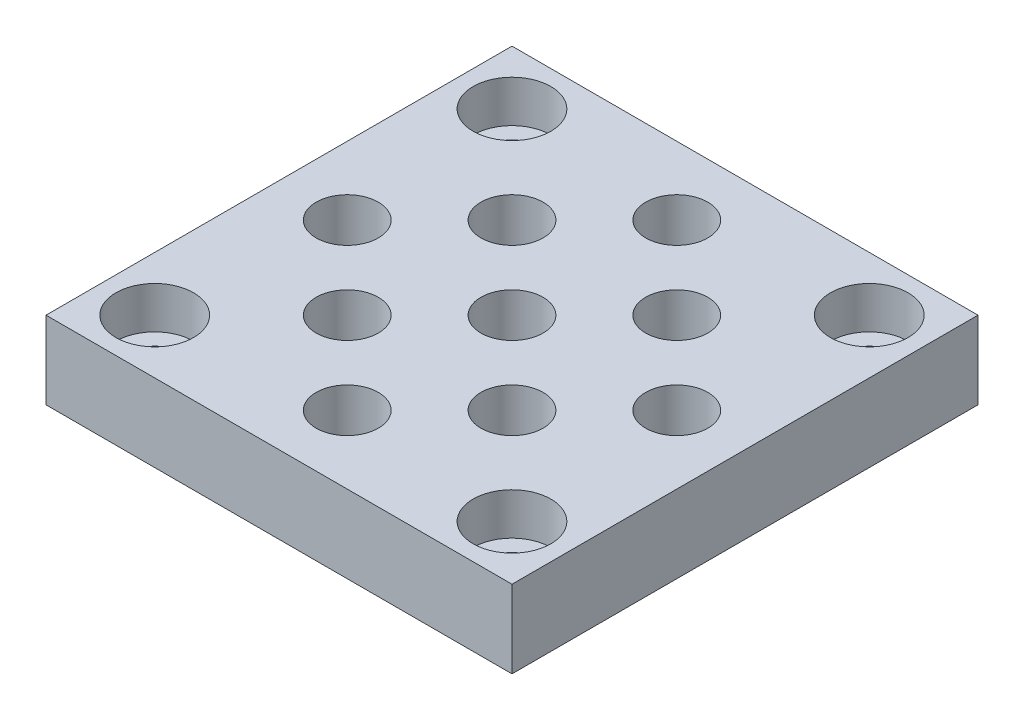
ISO-10303-21;
HEADER;
FILE_DESCRIPTION(('STEP AP214'),'2;1');
FILE_NAME('part.step','',(''),(''),'','','');
FILE_SCHEMA(('AUTOMOTIVE_DESIGN { 1 0 10303 214 1 1 1 1 }'));
ENDSEC;
DATA;
#1=APPLICATION_CONTEXT('core data for automotive mechanical design processes');
#2=APPLICATION_PROTOCOL_DEFINITION('international standard','automotive_design',2000,#1);
#3=PRODUCT_CONTEXT('',#1,'mechanical');
#4=PRODUCT('Part','Part','',(#3));
#5=PRODUCT_RELATED_PRODUCT_CATEGORY('part','',(#4));
#6=PRODUCT_DEFINITION_FORMATION('','',#4);
#7=PRODUCT_DEFINITION_CONTEXT('part definition',#1,'design');
#8=PRODUCT_DEFINITION('design','',#6,#7);
#9=PRODUCT_DEFINITION_SHAPE('','',#8);
#10=(LENGTH_UNIT() NAMED_UNIT(*) SI_UNIT(.MILLI.,.METRE.));
#11=(NAMED_UNIT(*) PLANE_ANGLE_UNIT() SI_UNIT($,.RADIAN.));
#12=(NAMED_UNIT(*) SI_UNIT($,.STERADIAN.) SOLID_ANGLE_UNIT());
#13=UNCERTAINTY_MEASURE_WITH_UNIT(LENGTH_MEASURE(1.E-05),#10,'distance_accuracy_value','');
#14=(GEOMETRIC_REPRESENTATION_CONTEXT(3) GLOBAL_UNCERTAINTY_ASSIGNED_CONTEXT((#13)) GLOBAL_UNIT_ASSIGNED_CONTEXT((#10,
#11,#12)) REPRESENTATION_CONTEXT('',''));
#15=CARTESIAN_POINT('',(0.,0.,0.));
#16=DIRECTION('',(0.,0.,1.));
#17=DIRECTION('',(1.,0.,0.));
#18=AXIS2_PLACEMENT_3D('',#15,#16,#17);
#19=CARTESIAN_POINT('',(30.,10.,-30.));
#20=DIRECTION('',(-1.,0.,0.));
#21=DIRECTION('',(0.,0.,1.));
#22=AXIS2_PLACEMENT_3D('',#19,#20,#21);
#23=PLANE('',#22);
#24=DIRECTION('',(0.,0.,-1.));
#25=VECTOR('',#24,1.);
#26=CARTESIAN_POINT('',(30.,0.,-30.));
#27=LINE('',#26,#25);
#28=CARTESIAN_POINT('',(30.,0.,30.));
#29=VERTEX_POINT('',#28);
#30=CARTESIAN_POINT('',(30.,0.,-30.));
#31=VERTEX_POINT('',#30);
#32=EDGE_CURVE('E113',#29,#31,#27,.T.);
#33=ORIENTED_EDGE('',*,*,#32,.T.);
#34=DIRECTION('',(0.,-1.,0.));
#35=VECTOR('',#34,1.);
#36=CARTESIAN_POINT('',(30.,10.,-30.));
#37=LINE('',#36,#35);
#38=CARTESIAN_POINT('',(30.,10.,-30.));
#39=VERTEX_POINT('',#38);
#40=EDGE_CURVE('E104',#39,#31,#37,.T.);
#41=ORIENTED_EDGE('',*,*,#40,.F.);
#42=DIRECTION('',(0.,0.,-1.));
#43=VECTOR('',#42,1.);
#44=CARTESIAN_POINT('',(30.,10.,-30.));
#45=LINE('',#44,#43);
#46=CARTESIAN_POINT('',(30.,10.,30.));
#47=VERTEX_POINT('',#46);
#48=EDGE_CURVE('E98',#47,#39,#45,.T.);
#49=ORIENTED_EDGE('',*,*,#48,.F.);
#50=DIRECTION('',(0.,-1.,0.));
#51=VECTOR('',#50,1.);
#52=CARTESIAN_POINT('',(30.,10.,30.));
#53=LINE('',#52,#51);
#54=EDGE_CURVE('E109',#47,#29,#53,.T.);
#55=ORIENTED_EDGE('',*,*,#54,.T.);
#56=EDGE_LOOP('',(#33,#41,#49,#55));
#57=FACE_BOUND('',#56,.T.);
#58=ADVANCED_FACE('F44',(#57),#23,.F.);
#59=CARTESIAN_POINT('',(-30.,10.,-30.));
#60=DIRECTION('',(0.,0.,1.));
#61=DIRECTION('',(1.,0.,0.));
#62=AXIS2_PLACEMENT_3D('',#59,#60,#61);
#63=PLANE('',#62);
#64=DIRECTION('',(-1.,0.,0.));
#65=VECTOR('',#64,1.);
#66=CARTESIAN_POINT('',(-30.,0.,-30.));
#67=LINE('',#66,#65);
#68=CARTESIAN_POINT('',(-30.,0.,-30.));
#69=VERTEX_POINT('',#68);
#70=EDGE_CURVE('E103',#31,#69,#67,.T.);
#71=ORIENTED_EDGE('',*,*,#70,.T.);
#72=DIRECTION('',(0.,-1.,0.));
#73=VECTOR('',#72,1.);
#74=CARTESIAN_POINT('',(-30.,10.,-30.));
#75=LINE('',#74,#73);
#76=CARTESIAN_POINT('',(-30.,10.,-30.));
#77=VERTEX_POINT('',#76);
#78=EDGE_CURVE('E101',#77,#69,#75,.T.);
#79=ORIENTED_EDGE('',*,*,#78,.F.);
#80=DIRECTION('',(-1.,0.,0.));
#81=VECTOR('',#80,1.);
#82=CARTESIAN_POINT('',(-30.,10.,-30.));
#83=LINE('',#82,#81);
#84=EDGE_CURVE('E92',#39,#77,#83,.T.);
#85=ORIENTED_EDGE('',*,*,#84,.F.);
#86=ORIENTED_EDGE('',*,*,#40,.T.);
#87=EDGE_LOOP('',(#71,#79,#85,#86));
#88=FACE_BOUND('',#87,.T.);
#89=ADVANCED_FACE('F102',(#88),#63,.F.);
#90=CARTESIAN_POINT('',(-30.,10.,-30.));
#91=DIRECTION('',(1.,0.,0.));
#92=DIRECTION('',(0.,0.,-1.));
#93=AXIS2_PLACEMENT_3D('',#90,#91,#92);
#94=PLANE('',#93);
#95=DIRECTION('',(0.,0.,1.));
#96=VECTOR('',#95,1.);
#97=CARTESIAN_POINT('',(-30.,0.,-30.));
#98=LINE('',#97,#96);
#99=CARTESIAN_POINT('',(-30.,0.,30.));
#100=VERTEX_POINT('',#99);
#101=EDGE_CURVE('E78',#69,#100,#98,.T.);
#102=ORIENTED_EDGE('',*,*,#101,.T.);
#103=DIRECTION('',(0.,-1.,0.));
#104=VECTOR('',#103,1.);
#105=CARTESIAN_POINT('',(-30.,10.,30.));
#106=LINE('',#105,#104);
#107=CARTESIAN_POINT('',(-30.,10.,30.));
#108=VERTEX_POINT('',#107);
#109=EDGE_CURVE('E105',#108,#100,#106,.T.);
#110=ORIENTED_EDGE('',*,*,#109,.F.);
#111=DIRECTION('',(0.,0.,1.));
#112=VECTOR('',#111,1.);
#113=CARTESIAN_POINT('',(-30.,10.,-30.));
#114=LINE('',#113,#112);
#115=EDGE_CURVE('E96',#77,#108,#114,.T.);
#116=ORIENTED_EDGE('',*,*,#115,.F.);
#117=ORIENTED_EDGE('',*,*,#78,.T.);
#118=EDGE_LOOP('',(#102,#110,#116,#117));
#119=FACE_BOUND('',#118,.T.);
#120=ADVANCED_FACE('F107',(#119),#94,.F.);
#121=CARTESIAN_POINT('',(-30.,10.,30.));
#122=DIRECTION('',(0.,0.,-1.));
#123=DIRECTION('',(-1.,0.,0.));
#124=AXIS2_PLACEMENT_3D('',#121,#122,#123);
#125=PLANE('',#124);
#126=DIRECTION('',(1.,0.,0.));
#127=VECTOR('',#126,1.);
#128=CARTESIAN_POINT('',(-30.,0.,30.));
#129=LINE('',#128,#127);
#130=EDGE_CURVE('E84',#100,#29,#129,.T.);
#131=ORIENTED_EDGE('',*,*,#130,.T.);
#132=ORIENTED_EDGE('',*,*,#54,.F.);
#133=DIRECTION('',(1.,0.,0.));
#134=VECTOR('',#133,1.);
#135=CARTESIAN_POINT('',(-30.,10.,30.));
#136=LINE('',#135,#134);
#137=EDGE_CURVE('E61',#108,#47,#136,.T.);
#138=ORIENTED_EDGE('',*,*,#137,.F.);
#139=ORIENTED_EDGE('',*,*,#109,.T.);
#140=EDGE_LOOP('',(#131,#132,#138,#139));
#141=FACE_BOUND('',#140,.T.);
#142=ADVANCED_FACE('F170',(#141),#125,.F.);
#143=CARTESIAN_POINT('',(0.,10.,0.));
#144=DIRECTION('',(0.,1.,0.));
#145=DIRECTION('',(0.,0.,1.));
#146=AXIS2_PLACEMENT_3D('',#143,#144,#145);
#147=PLANE('',#146);
#148=CARTESIAN_POINT('',(-23.,10.,-23.));
#149=DIRECTION('',(0.,1.,0.));
#150=DIRECTION('',(0.,0.,1.));
#151=AXIS2_PLACEMENT_3D('',#148,#149,#150);
#152=CIRCLE('',#151,5.);
#153=CARTESIAN_POINT('',(-23.,10.,-18.));
#154=VERTEX_POINT('',#153);
#155=EDGE_CURVE('E492',#154,#154,#152,.T.);
#156=ORIENTED_EDGE('',*,*,#155,.F.);
#157=EDGE_LOOP('',(#156));
#158=FACE_BOUND('',#157,.T.);
#159=CARTESIAN_POINT('',(23.,10.,-23.));
#160=DIRECTION('',(0.,1.,0.));
#161=DIRECTION('',(0.,0.,1.));
#162=AXIS2_PLACEMENT_3D('',#159,#160,#161);
#163=CIRCLE('',#162,5.);
#164=CARTESIAN_POINT('',(23.,10.,-18.));
#165=VERTEX_POINT('',#164);
#166=EDGE_CURVE('E480',#165,#165,#163,.T.);
#167=ORIENTED_EDGE('',*,*,#166,.F.);
#168=EDGE_LOOP('',(#167));
#169=FACE_BOUND('',#168,.T.);
#170=CARTESIAN_POINT('',(23.,10.,23.));
#171=DIRECTION('',(0.,1.,0.));
#172=DIRECTION('',(0.,0.,1.));
#173=AXIS2_PLACEMENT_3D('',#170,#171,#172);
#174=CIRCLE('',#173,5.);
#175=CARTESIAN_POINT('',(23.,10.,28.));
#176=VERTEX_POINT('',#175);
#177=EDGE_CURVE('E468',#176,#176,#174,.T.);
#178=ORIENTED_EDGE('',*,*,#177,.F.);
#179=EDGE_LOOP('',(#178));
#180=FACE_BOUND('',#179,.T.);
#181=CARTESIAN_POINT('',(-23.,10.,23.));
#182=DIRECTION('',(0.,1.,0.));
#183=DIRECTION('',(0.,0.,1.));
#184=AXIS2_PLACEMENT_3D('',#181,#182,#183);
#185=CIRCLE('',#184,5.);
#186=CARTESIAN_POINT('',(-23.,10.,28.));
#187=VERTEX_POINT('',#186);
#188=EDGE_CURVE('E456',#187,#187,#185,.T.);
#189=ORIENTED_EDGE('',*,*,#188,.F.);
#190=EDGE_LOOP('',(#189));
#191=FACE_BOUND('',#190,.T.);
#192=CARTESIAN_POINT('',(10.6066017177982,10.,10.6066017177982));
#193=DIRECTION('',(0.,1.,0.));
#194=DIRECTION('',(0.,0.,1.));
#195=AXIS2_PLACEMENT_3D('',#192,#193,#194);
#196=CIRCLE('',#195,4.);
#197=CARTESIAN_POINT('',(10.6066017177982,10.,14.6066017177982));
#198=VERTEX_POINT('',#197);
#199=EDGE_CURVE('E438',#198,#198,#196,.T.);
#200=ORIENTED_EDGE('',*,*,#199,.F.);
#201=EDGE_LOOP('',(#200));
#202=FACE_BOUND('',#201,.T.);
#203=CARTESIAN_POINT('',(0.,10.,21.2132034355964));
#204=DIRECTION('',(0.,1.,0.));
#205=DIRECTION('',(0.,0.,1.));
#206=AXIS2_PLACEMENT_3D('',#203,#204,#205);
#207=CIRCLE('',#206,4.);
#208=CARTESIAN_POINT('',(0.,10.,25.2132034355964));
#209=VERTEX_POINT('',#208);
#210=EDGE_CURVE('E436',#209,#209,#207,.T.);
#211=ORIENTED_EDGE('',*,*,#210,.F.);
#212=EDGE_LOOP('',(#211));
#213=FACE_BOUND('',#212,.T.);
#214=ORIENTED_EDGE('',*,*,#48,.T.);
#215=ORIENTED_EDGE('',*,*,#84,.T.);
#216=ORIENTED_EDGE('',*,*,#115,.T.);
#217=ORIENTED_EDGE('',*,*,#137,.T.);
#218=EDGE_LOOP('',(#214,#215,#216,#217));
#219=FACE_BOUND('',#218,.T.);
#220=CARTESIAN_POINT('',(21.2132034355964,10.,0.));
#221=DIRECTION('',(0.,1.,0.));
#222=DIRECTION('',(0.,0.,1.));
#223=AXIS2_PLACEMENT_3D('',#220,#221,#222);
#224=CIRCLE('',#223,4.);
#225=CARTESIAN_POINT('',(21.2132034355964,10.,4.));
#226=VERTEX_POINT('',#225);
#227=EDGE_CURVE('E126',#226,#226,#224,.T.);
#228=ORIENTED_EDGE('',*,*,#227,.F.);
#229=EDGE_LOOP('',(#228));
#230=FACE_BOUND('',#229,.T.);
#231=CARTESIAN_POINT('',(-10.6066017177982,10.,10.6066017177982));
#232=DIRECTION('',(0.,1.,0.));
#233=DIRECTION('',(0.,0.,1.));
#234=AXIS2_PLACEMENT_3D('',#231,#232,#233);
#235=CIRCLE('',#234,4.);
#236=CARTESIAN_POINT('',(-10.6066017177982,10.,14.6066017177982));
#237=VERTEX_POINT('',#236);
#238=EDGE_CURVE('E132',#237,#237,#235,.T.);
#239=ORIENTED_EDGE('',*,*,#238,.F.);
#240=EDGE_LOOP('',(#239));
#241=FACE_BOUND('',#240,.T.);
#242=CARTESIAN_POINT('',(0.,10.,0.));
#243=DIRECTION('',(0.,1.,0.));
#244=DIRECTION('',(0.,0.,1.));
#245=AXIS2_PLACEMENT_3D('',#242,#243,#244);
#246=CIRCLE('',#245,4.);
#247=CARTESIAN_POINT('',(0.,10.,4.));
#248=VERTEX_POINT('',#247);
#249=EDGE_CURVE('E138',#248,#248,#246,.T.);
#250=ORIENTED_EDGE('',*,*,#249,.F.);
#251=EDGE_LOOP('',(#250));
#252=FACE_BOUND('',#251,.T.);
#253=CARTESIAN_POINT('',(10.6066017177982,10.,-10.6066017177982));
#254=DIRECTION('',(0.,1.,0.));
#255=DIRECTION('',(0.,0.,1.));
#256=AXIS2_PLACEMENT_3D('',#253,#254,#255);
#257=CIRCLE('',#256,4.);
#258=CARTESIAN_POINT('',(10.6066017177982,10.,-6.60660171779821));
#259=VERTEX_POINT('',#258);
#260=EDGE_CURVE('E144',#259,#259,#257,.T.);
#261=ORIENTED_EDGE('',*,*,#260,.F.);
#262=EDGE_LOOP('',(#261));
#263=FACE_BOUND('',#262,.T.);
#264=CARTESIAN_POINT('',(-21.2132034355964,10.,0.));
#265=DIRECTION('',(0.,1.,0.));
#266=DIRECTION('',(0.,0.,1.));
#267=AXIS2_PLACEMENT_3D('',#264,#265,#266);
#268=CIRCLE('',#267,4.);
#269=CARTESIAN_POINT('',(-21.2132034355964,10.,4.));
#270=VERTEX_POINT('',#269);
#271=EDGE_CURVE('E150',#270,#270,#268,.T.);
#272=ORIENTED_EDGE('',*,*,#271,.F.);
#273=EDGE_LOOP('',(#272));
#274=FACE_BOUND('',#273,.T.);
#275=CARTESIAN_POINT('',(-10.6066017177982,10.,-10.6066017177982));
#276=DIRECTION('',(0.,1.,0.));
#277=DIRECTION('',(0.,0.,1.));
#278=AXIS2_PLACEMENT_3D('',#275,#276,#277);
#279=CIRCLE('',#278,4.);
#280=CARTESIAN_POINT('',(-10.6066017177982,10.,-6.60660171779821));
#281=VERTEX_POINT('',#280);
#282=EDGE_CURVE('E156',#281,#281,#279,.T.);
#283=ORIENTED_EDGE('',*,*,#282,.F.);
#284=EDGE_LOOP('',(#283));
#285=FACE_BOUND('',#284,.T.);
#286=CARTESIAN_POINT('',(0.,10.,-21.2132034355964));
#287=DIRECTION('',(0.,1.,0.));
#288=DIRECTION('',(0.,0.,1.));
#289=AXIS2_PLACEMENT_3D('',#286,#287,#288);
#290=CIRCLE('',#289,4.);
#291=CARTESIAN_POINT('',(0.,10.,-17.2132034355964));
#292=VERTEX_POINT('',#291);
#293=EDGE_CURVE('E13',#292,#292,#290,.T.);
#294=ORIENTED_EDGE('',*,*,#293,.F.);
#295=EDGE_LOOP('',(#294));
#296=FACE_BOUND('',#295,.T.);
#297=ADVANCED_FACE('F93',(#158,#169,#180,#191,#202,#213,#219,#230,#241,#252,#263,#274,#285,
#296),#147,.T.);
#298=CARTESIAN_POINT('',(0.,0.,0.));
#299=DIRECTION('',(0.,1.,0.));
#300=DIRECTION('',(0.,0.,1.));
#301=AXIS2_PLACEMENT_3D('',#298,#299,#300);
#302=PLANE('',#301);
#303=CARTESIAN_POINT('',(-23.,0.,-23.));
#304=DIRECTION('',(0.,1.,0.));
#305=DIRECTION('',(0.,0.,1.));
#306=AXIS2_PLACEMENT_3D('',#303,#304,#305);
#307=CIRCLE('',#306,2.75);
#308=CARTESIAN_POINT('',(-23.,0.,-20.25));
#309=VERTEX_POINT('',#308);
#310=EDGE_CURVE('E483',#309,#309,#307,.T.);
#311=ORIENTED_EDGE('',*,*,#310,.T.);
#312=EDGE_LOOP('',(#311));
#313=FACE_BOUND('',#312,.T.);
#314=CARTESIAN_POINT('',(23.,0.,-23.));
#315=DIRECTION('',(0.,1.,0.));
#316=DIRECTION('',(0.,0.,1.));
#317=AXIS2_PLACEMENT_3D('',#314,#315,#316);
#318=CIRCLE('',#317,2.75);
#319=CARTESIAN_POINT('',(23.,0.,-20.25));
#320=VERTEX_POINT('',#319);
#321=EDGE_CURVE('E471',#320,#320,#318,.T.);
#322=ORIENTED_EDGE('',*,*,#321,.T.);
#323=EDGE_LOOP('',(#322));
#324=FACE_BOUND('',#323,.T.);
#325=CARTESIAN_POINT('',(23.,0.,23.));
#326=DIRECTION('',(0.,1.,0.));
#327=DIRECTION('',(0.,0.,1.));
#328=AXIS2_PLACEMENT_3D('',#325,#326,#327);
#329=CIRCLE('',#328,2.75);
#330=CARTESIAN_POINT('',(23.,0.,25.75));
#331=VERTEX_POINT('',#330);
#332=EDGE_CURVE('E459',#331,#331,#329,.T.);
#333=ORIENTED_EDGE('',*,*,#332,.T.);
#334=EDGE_LOOP('',(#333));
#335=FACE_BOUND('',#334,.T.);
#336=CARTESIAN_POINT('',(-23.,0.,23.));
#337=DIRECTION('',(0.,1.,0.));
#338=DIRECTION('',(0.,0.,1.));
#339=AXIS2_PLACEMENT_3D('',#336,#337,#338);
#340=CIRCLE('',#339,2.75);
#341=CARTESIAN_POINT('',(-23.,0.,25.75));
#342=VERTEX_POINT('',#341);
#343=EDGE_CURVE('E447',#342,#342,#340,.T.);
#344=ORIENTED_EDGE('',*,*,#343,.T.);
#345=EDGE_LOOP('',(#344));
#346=FACE_BOUND('',#345,.T.);
#347=CARTESIAN_POINT('',(10.6066017177982,0.,10.6066017177982));
#348=DIRECTION('',(0.,1.,0.));
#349=DIRECTION('',(0.,0.,1.));
#350=AXIS2_PLACEMENT_3D('',#347,#348,#349);
#351=CIRCLE('',#350,4.);
#352=CARTESIAN_POINT('',(10.6066017177982,0.,14.6066017177982));
#353=VERTEX_POINT('',#352);
#354=EDGE_CURVE('E442',#353,#353,#351,.T.);
#355=ORIENTED_EDGE('',*,*,#354,.T.);
#356=EDGE_LOOP('',(#355));
#357=FACE_BOUND('',#356,.T.);
#358=CARTESIAN_POINT('',(0.,0.,21.2132034355964));
#359=DIRECTION('',(0.,1.,0.));
#360=DIRECTION('',(0.,0.,1.));
#361=AXIS2_PLACEMENT_3D('',#358,#359,#360);
#362=CIRCLE('',#361,4.);
#363=CARTESIAN_POINT('',(0.,0.,25.2132034355964));
#364=VERTEX_POINT('',#363);
#365=EDGE_CURVE('E116',#364,#364,#362,.T.);
#366=ORIENTED_EDGE('',*,*,#365,.T.);
#367=EDGE_LOOP('',(#366));
#368=FACE_BOUND('',#367,.T.);
#369=ORIENTED_EDGE('',*,*,#32,.F.);
#370=ORIENTED_EDGE('',*,*,#130,.F.);
#371=ORIENTED_EDGE('',*,*,#101,.F.);
#372=ORIENTED_EDGE('',*,*,#70,.F.);
#373=EDGE_LOOP('',(#369,#370,#371,#372));
#374=FACE_BOUND('',#373,.T.);
#375=CARTESIAN_POINT('',(21.2132034355964,0.,0.));
#376=DIRECTION('',(0.,1.,0.));
#377=DIRECTION('',(0.,0.,1.));
#378=AXIS2_PLACEMENT_3D('',#375,#376,#377);
#379=CIRCLE('',#378,4.);
#380=CARTESIAN_POINT('',(21.2132034355964,0.,4.));
#381=VERTEX_POINT('',#380);
#382=EDGE_CURVE('E123',#381,#381,#379,.T.);
#383=ORIENTED_EDGE('',*,*,#382,.T.);
#384=EDGE_LOOP('',(#383));
#385=FACE_BOUND('',#384,.T.);
#386=CARTESIAN_POINT('',(-10.6066017177982,0.,10.6066017177982));
#387=DIRECTION('',(0.,1.,0.));
#388=DIRECTION('',(0.,0.,1.));
#389=AXIS2_PLACEMENT_3D('',#386,#387,#388);
#390=CIRCLE('',#389,4.);
#391=CARTESIAN_POINT('',(-10.6066017177982,0.,14.6066017177982));
#392=VERTEX_POINT('',#391);
#393=EDGE_CURVE('E129',#392,#392,#390,.T.);
#394=ORIENTED_EDGE('',*,*,#393,.T.);
#395=EDGE_LOOP('',(#394));
#396=FACE_BOUND('',#395,.T.);
#397=CARTESIAN_POINT('',(0.,0.,0.));
#398=DIRECTION('',(0.,1.,0.));
#399=DIRECTION('',(0.,0.,1.));
#400=AXIS2_PLACEMENT_3D('',#397,#398,#399);
#401=CIRCLE('',#400,4.);
#402=CARTESIAN_POINT('',(0.,0.,4.));
#403=VERTEX_POINT('',#402);
#404=EDGE_CURVE('E135',#403,#403,#401,.T.);
#405=ORIENTED_EDGE('',*,*,#404,.T.);
#406=EDGE_LOOP('',(#405));
#407=FACE_BOUND('',#406,.T.);
#408=CARTESIAN_POINT('',(10.6066017177982,0.,-10.6066017177982));
#409=DIRECTION('',(0.,1.,0.));
#410=DIRECTION('',(0.,0.,1.));
#411=AXIS2_PLACEMENT_3D('',#408,#409,#410);
#412=CIRCLE('',#411,4.);
#413=CARTESIAN_POINT('',(10.6066017177982,0.,-6.60660171779821));
#414=VERTEX_POINT('',#413);
#415=EDGE_CURVE('E141',#414,#414,#412,.T.);
#416=ORIENTED_EDGE('',*,*,#415,.T.);
#417=EDGE_LOOP('',(#416));
#418=FACE_BOUND('',#417,.T.);
#419=CARTESIAN_POINT('',(-21.2132034355964,0.,0.));
#420=DIRECTION('',(0.,1.,0.));
#421=DIRECTION('',(0.,0.,1.));
#422=AXIS2_PLACEMENT_3D('',#419,#420,#421);
#423=CIRCLE('',#422,4.);
#424=CARTESIAN_POINT('',(-21.2132034355964,0.,4.));
#425=VERTEX_POINT('',#424);
#426=EDGE_CURVE('E147',#425,#425,#423,.T.);
#427=ORIENTED_EDGE('',*,*,#426,.T.);
#428=EDGE_LOOP('',(#427));
#429=FACE_BOUND('',#428,.T.);
#430=CARTESIAN_POINT('',(-10.6066017177982,0.,-10.6066017177982));
#431=DIRECTION('',(0.,1.,0.));
#432=DIRECTION('',(0.,0.,1.));
#433=AXIS2_PLACEMENT_3D('',#430,#431,#432);
#434=CIRCLE('',#433,4.);
#435=CARTESIAN_POINT('',(-10.6066017177982,0.,-6.60660171779821));
#436=VERTEX_POINT('',#435);
#437=EDGE_CURVE('E153',#436,#436,#434,.T.);
#438=ORIENTED_EDGE('',*,*,#437,.T.);
#439=EDGE_LOOP('',(#438));
#440=FACE_BOUND('',#439,.T.);
#441=CARTESIAN_POINT('',(0.,0.,-21.2132034355964));
#442=DIRECTION('',(0.,1.,0.));
#443=DIRECTION('',(0.,0.,1.));
#444=AXIS2_PLACEMENT_3D('',#441,#442,#443);
#445=CIRCLE('',#444,4.);
#446=CARTESIAN_POINT('',(0.,0.,-17.2132034355964));
#447=VERTEX_POINT('',#446);
#448=EDGE_CURVE('E53',#447,#447,#445,.T.);
#449=ORIENTED_EDGE('',*,*,#448,.T.);
#450=EDGE_LOOP('',(#449));
#451=FACE_BOUND('',#450,.T.);
#452=ADVANCED_FACE('F161',(#313,#324,#335,#346,#357,#368,#374,#385,#396,#407,#418,#429,#440,
#451),#302,.F.);
#453=CARTESIAN_POINT('',(0.,0.,21.2132034355964));
#454=DIRECTION('',(0.,1.,0.));
#455=DIRECTION('',(0.,0.,1.));
#456=AXIS2_PLACEMENT_3D('',#453,#454,#455);
#457=CYLINDRICAL_SURFACE('',#456,4.);
#458=ORIENTED_EDGE('',*,*,#365,.F.);
#459=EDGE_LOOP('',(#458));
#460=FACE_BOUND('',#459,.T.);
#461=ORIENTED_EDGE('',*,*,#210,.T.);
#462=EDGE_LOOP('',(#461));
#463=FACE_BOUND('',#462,.T.);
#464=ADVANCED_FACE('F177',(#460,#463),#457,.F.);
#465=CARTESIAN_POINT('',(10.6066017177982,0.,10.6066017177982));
#466=DIRECTION('',(0.,1.,0.));
#467=DIRECTION('',(0.,0.,1.));
#468=AXIS2_PLACEMENT_3D('',#465,#466,#467);
#469=CYLINDRICAL_SURFACE('',#468,4.);
#470=ORIENTED_EDGE('',*,*,#354,.F.);
#471=EDGE_LOOP('',(#470));
#472=FACE_BOUND('',#471,.T.);
#473=ORIENTED_EDGE('',*,*,#199,.T.);
#474=EDGE_LOOP('',(#473));
#475=FACE_BOUND('',#474,.T.);
#476=ADVANCED_FACE('F197',(#472,#475),#469,.F.);
#477=CARTESIAN_POINT('',(21.2132034355964,0.,0.));
#478=DIRECTION('',(0.,1.,0.));
#479=DIRECTION('',(0.,0.,1.));
#480=AXIS2_PLACEMENT_3D('',#477,#478,#479);
#481=CYLINDRICAL_SURFACE('',#480,4.);
#482=ORIENTED_EDGE('',*,*,#382,.F.);
#483=EDGE_LOOP('',(#482));
#484=FACE_BOUND('',#483,.T.);
#485=ORIENTED_EDGE('',*,*,#227,.T.);
#486=EDGE_LOOP('',(#485));
#487=FACE_BOUND('',#486,.T.);
#488=ADVANCED_FACE('F193',(#484,#487),#481,.F.);
#489=CARTESIAN_POINT('',(-10.6066017177982,0.,10.6066017177982));
#490=DIRECTION('',(0.,1.,0.));
#491=DIRECTION('',(0.,0.,1.));
#492=AXIS2_PLACEMENT_3D('',#489,#490,#491);
#493=CYLINDRICAL_SURFACE('',#492,4.);
#494=ORIENTED_EDGE('',*,*,#393,.F.);
#495=EDGE_LOOP('',(#494));
#496=FACE_BOUND('',#495,.T.);
#497=ORIENTED_EDGE('',*,*,#238,.T.);
#498=EDGE_LOOP('',(#497));
#499=FACE_BOUND('',#498,.T.);
#500=ADVANCED_FACE('F196',(#496,#499),#493,.F.);
#501=CARTESIAN_POINT('',(0.,0.,0.));
#502=DIRECTION('',(0.,1.,0.));
#503=DIRECTION('',(0.,0.,1.));
#504=AXIS2_PLACEMENT_3D('',#501,#502,#503);
#505=CYLINDRICAL_SURFACE('',#504,4.);
#506=ORIENTED_EDGE('',*,*,#404,.F.);
#507=EDGE_LOOP('',(#506));
#508=FACE_BOUND('',#507,.T.);
#509=ORIENTED_EDGE('',*,*,#249,.T.);
#510=EDGE_LOOP('',(#509));
#511=FACE_BOUND('',#510,.T.);
#512=ADVANCED_FACE('F201',(#508,#511),#505,.F.);
#513=CARTESIAN_POINT('',(10.6066017177982,0.,-10.6066017177982));
#514=DIRECTION('',(0.,1.,0.));
#515=DIRECTION('',(0.,0.,1.));
#516=AXIS2_PLACEMENT_3D('',#513,#514,#515);
#517=CYLINDRICAL_SURFACE('',#516,4.);
#518=ORIENTED_EDGE('',*,*,#415,.F.);
#519=EDGE_LOOP('',(#518));
#520=FACE_BOUND('',#519,.T.);
#521=ORIENTED_EDGE('',*,*,#260,.T.);
#522=EDGE_LOOP('',(#521));
#523=FACE_BOUND('',#522,.T.);
#524=ADVANCED_FACE('F205',(#520,#523),#517,.F.);
#525=CARTESIAN_POINT('',(-21.2132034355964,0.,0.));
#526=DIRECTION('',(0.,1.,0.));
#527=DIRECTION('',(0.,0.,1.));
#528=AXIS2_PLACEMENT_3D('',#525,#526,#527);
#529=CYLINDRICAL_SURFACE('',#528,4.);
#530=ORIENTED_EDGE('',*,*,#426,.F.);
#531=EDGE_LOOP('',(#530));
#532=FACE_BOUND('',#531,.T.);
#533=ORIENTED_EDGE('',*,*,#271,.T.);
#534=EDGE_LOOP('',(#533));
#535=FACE_BOUND('',#534,.T.);
#536=ADVANCED_FACE('F209',(#532,#535),#529,.F.);
#537=CARTESIAN_POINT('',(-10.6066017177982,0.,-10.6066017177982));
#538=DIRECTION('',(0.,1.,0.));
#539=DIRECTION('',(0.,0.,1.));
#540=AXIS2_PLACEMENT_3D('',#537,#538,#539);
#541=CYLINDRICAL_SURFACE('',#540,4.);
#542=ORIENTED_EDGE('',*,*,#437,.F.);
#543=EDGE_LOOP('',(#542));
#544=FACE_BOUND('',#543,.T.);
#545=ORIENTED_EDGE('',*,*,#282,.T.);
#546=EDGE_LOOP('',(#545));
#547=FACE_BOUND('',#546,.T.);
#548=ADVANCED_FACE('F166',(#544,#547),#541,.F.);
#549=CARTESIAN_POINT('',(0.,0.,-21.2132034355964));
#550=DIRECTION('',(0.,1.,0.));
#551=DIRECTION('',(0.,0.,1.));
#552=AXIS2_PLACEMENT_3D('',#549,#550,#551);
#553=CYLINDRICAL_SURFACE('',#552,4.);
#554=ORIENTED_EDGE('',*,*,#448,.F.);
#555=EDGE_LOOP('',(#554));
#556=FACE_BOUND('',#555,.T.);
#557=ORIENTED_EDGE('',*,*,#293,.T.);
#558=EDGE_LOOP('',(#557));
#559=FACE_BOUND('',#558,.T.);
#560=ADVANCED_FACE('F46',(#556,#559),#553,.F.);
#561=CARTESIAN_POINT('',(-23.,10.,23.));
#562=DIRECTION('',(0.,1.,0.));
#563=DIRECTION('',(0.,0.,1.));
#564=AXIS2_PLACEMENT_3D('',#561,#562,#563);
#565=CYLINDRICAL_SURFACE('',#564,2.75);
#566=ORIENTED_EDGE('',*,*,#343,.F.);
#567=EDGE_LOOP('',(#566));
#568=FACE_BOUND('',#567,.T.);
#569=CARTESIAN_POINT('',(-23.,4.6,23.));
#570=DIRECTION('',(0.,1.,0.));
#571=DIRECTION('',(0.,0.,1.));
#572=AXIS2_PLACEMENT_3D('',#569,#570,#571);
#573=CIRCLE('',#572,2.75);
#574=CARTESIAN_POINT('',(-23.,4.6,25.75));
#575=VERTEX_POINT('',#574);
#576=EDGE_CURVE('E450',#575,#575,#573,.T.);
#577=ORIENTED_EDGE('',*,*,#576,.T.);
#578=EDGE_LOOP('',(#577));
#579=FACE_BOUND('',#578,.T.);
#580=ADVANCED_FACE('F165',(#568,#579),#565,.F.);
#581=CARTESIAN_POINT('',(-20.25,4.6,23.));
#582=DIRECTION('',(0.,-1.,0.));
#583=DIRECTION('',(0.,0.,-1.));
#584=AXIS2_PLACEMENT_3D('',#581,#582,#583);
#585=PLANE('',#584);
#586=ORIENTED_EDGE('',*,*,#576,.F.);
#587=EDGE_LOOP('',(#586));
#588=FACE_BOUND('',#587,.T.);
#589=CARTESIAN_POINT('',(-23.,4.6,23.));
#590=DIRECTION('',(0.,1.,0.));
#591=DIRECTION('',(0.,0.,1.));
#592=AXIS2_PLACEMENT_3D('',#589,#590,#591);
#593=CIRCLE('',#592,5.);
#594=CARTESIAN_POINT('',(-23.,4.6,28.));
#595=VERTEX_POINT('',#594);
#596=EDGE_CURVE('E453',#595,#595,#593,.T.);
#597=ORIENTED_EDGE('',*,*,#596,.T.);
#598=EDGE_LOOP('',(#597));
#599=FACE_BOUND('',#598,.T.);
#600=ADVANCED_FACE('F234',(#588,#599),#585,.F.);
#601=CARTESIAN_POINT('',(-23.,10.,23.));
#602=DIRECTION('',(0.,1.,0.));
#603=DIRECTION('',(0.,0.,1.));
#604=AXIS2_PLACEMENT_3D('',#601,#602,#603);
#605=CYLINDRICAL_SURFACE('',#604,5.);
#606=ORIENTED_EDGE('',*,*,#596,.F.);
#607=EDGE_LOOP('',(#606));
#608=FACE_BOUND('',#607,.T.);
#609=ORIENTED_EDGE('',*,*,#188,.T.);
#610=EDGE_LOOP('',(#609));
#611=FACE_BOUND('',#610,.T.);
#612=ADVANCED_FACE('F242',(#608,#611),#605,.F.);
#613=CARTESIAN_POINT('',(23.,10.,23.));
#614=DIRECTION('',(0.,1.,0.));
#615=DIRECTION('',(0.,0.,1.));
#616=AXIS2_PLACEMENT_3D('',#613,#614,#615);
#617=CYLINDRICAL_SURFACE('',#616,2.75);
#618=ORIENTED_EDGE('',*,*,#332,.F.);
#619=EDGE_LOOP('',(#618));
#620=FACE_BOUND('',#619,.T.);
#621=CARTESIAN_POINT('',(23.,4.6,23.));
#622=DIRECTION('',(0.,1.,0.));
#623=DIRECTION('',(0.,0.,1.));
#624=AXIS2_PLACEMENT_3D('',#621,#622,#623);
#625=CIRCLE('',#624,2.75);
#626=CARTESIAN_POINT('',(23.,4.6,25.75));
#627=VERTEX_POINT('',#626);
#628=EDGE_CURVE('E462',#627,#627,#625,.T.);
#629=ORIENTED_EDGE('',*,*,#628,.T.);
#630=EDGE_LOOP('',(#629));
#631=FACE_BOUND('',#630,.T.);
#632=ADVANCED_FACE('F250',(#620,#631),#617,.F.);
#633=CARTESIAN_POINT('',(25.75,4.6,23.));
#634=DIRECTION('',(0.,-1.,0.));
#635=DIRECTION('',(0.,0.,-1.));
#636=AXIS2_PLACEMENT_3D('',#633,#634,#635);
#637=PLANE('',#636);
#638=ORIENTED_EDGE('',*,*,#628,.F.);
#639=EDGE_LOOP('',(#638));
#640=FACE_BOUND('',#639,.T.);
#641=CARTESIAN_POINT('',(23.,4.6,23.));
#642=DIRECTION('',(0.,1.,0.));
#643=DIRECTION('',(0.,0.,1.));
#644=AXIS2_PLACEMENT_3D('',#641,#642,#643);
#645=CIRCLE('',#644,5.);
#646=CARTESIAN_POINT('',(23.,4.6,28.));
#647=VERTEX_POINT('',#646);
#648=EDGE_CURVE('E465',#647,#647,#645,.T.);
#649=ORIENTED_EDGE('',*,*,#648,.T.);
#650=EDGE_LOOP('',(#649));
#651=FACE_BOUND('',#650,.T.);
#652=ADVANCED_FACE('F258',(#640,#651),#637,.F.);
#653=CARTESIAN_POINT('',(23.,10.,23.));
#654=DIRECTION('',(0.,1.,0.));
#655=DIRECTION('',(0.,0.,1.));
#656=AXIS2_PLACEMENT_3D('',#653,#654,#655);
#657=CYLINDRICAL_SURFACE('',#656,5.);
#658=ORIENTED_EDGE('',*,*,#648,.F.);
#659=EDGE_LOOP('',(#658));
#660=FACE_BOUND('',#659,.T.);
#661=ORIENTED_EDGE('',*,*,#177,.T.);
#662=EDGE_LOOP('',(#661));
#663=FACE_BOUND('',#662,.T.);
#664=ADVANCED_FACE('F266',(#660,#663),#657,.F.);
#665=CARTESIAN_POINT('',(23.,10.,-23.));
#666=DIRECTION('',(0.,1.,0.));
#667=DIRECTION('',(0.,0.,1.));
#668=AXIS2_PLACEMENT_3D('',#665,#666,#667);
#669=CYLINDRICAL_SURFACE('',#668,2.75);
#670=ORIENTED_EDGE('',*,*,#321,.F.);
#671=EDGE_LOOP('',(#670));
#672=FACE_BOUND('',#671,.T.);
#673=CARTESIAN_POINT('',(23.,4.6,-23.));
#674=DIRECTION('',(0.,1.,0.));
#675=DIRECTION('',(0.,0.,1.));
#676=AXIS2_PLACEMENT_3D('',#673,#674,#675);
#677=CIRCLE('',#676,2.75);
#678=CARTESIAN_POINT('',(23.,4.6,-20.25));
#679=VERTEX_POINT('',#678);
#680=EDGE_CURVE('E474',#679,#679,#677,.T.);
#681=ORIENTED_EDGE('',*,*,#680,.T.);
#682=EDGE_LOOP('',(#681));
#683=FACE_BOUND('',#682,.T.);
#684=ADVANCED_FACE('F274',(#672,#683),#669,.F.);
#685=CARTESIAN_POINT('',(25.75,4.6,-23.));
#686=DIRECTION('',(0.,-1.,0.));
#687=DIRECTION('',(0.,0.,-1.));
#688=AXIS2_PLACEMENT_3D('',#685,#686,#687);
#689=PLANE('',#688);
#690=ORIENTED_EDGE('',*,*,#680,.F.);
#691=EDGE_LOOP('',(#690));
#692=FACE_BOUND('',#691,.T.);
#693=CARTESIAN_POINT('',(23.,4.6,-23.));
#694=DIRECTION('',(0.,1.,0.));
#695=DIRECTION('',(0.,0.,1.));
#696=AXIS2_PLACEMENT_3D('',#693,#694,#695);
#697=CIRCLE('',#696,5.);
#698=CARTESIAN_POINT('',(23.,4.6,-18.));
#699=VERTEX_POINT('',#698);
#700=EDGE_CURVE('E477',#699,#699,#697,.T.);
#701=ORIENTED_EDGE('',*,*,#700,.T.);
#702=EDGE_LOOP('',(#701));
#703=FACE_BOUND('',#702,.T.);
#704=ADVANCED_FACE('F282',(#692,#703),#689,.F.);
#705=CARTESIAN_POINT('',(23.,10.,-23.));
#706=DIRECTION('',(0.,1.,0.));
#707=DIRECTION('',(0.,0.,1.));
#708=AXIS2_PLACEMENT_3D('',#705,#706,#707);
#709=CYLINDRICAL_SURFACE('',#708,5.);
#710=ORIENTED_EDGE('',*,*,#700,.F.);
#711=EDGE_LOOP('',(#710));
#712=FACE_BOUND('',#711,.T.);
#713=ORIENTED_EDGE('',*,*,#166,.T.);
#714=EDGE_LOOP('',(#713));
#715=FACE_BOUND('',#714,.T.);
#716=ADVANCED_FACE('F290',(#712,#715),#709,.F.);
#717=CARTESIAN_POINT('',(-23.,10.,-23.));
#718=DIRECTION('',(0.,1.,0.));
#719=DIRECTION('',(0.,0.,1.));
#720=AXIS2_PLACEMENT_3D('',#717,#718,#719);
#721=CYLINDRICAL_SURFACE('',#720,2.75);
#722=ORIENTED_EDGE('',*,*,#310,.F.);
#723=EDGE_LOOP('',(#722));
#724=FACE_BOUND('',#723,.T.);
#725=CARTESIAN_POINT('',(-23.,4.6,-23.));
#726=DIRECTION('',(0.,1.,0.));
#727=DIRECTION('',(0.,0.,1.));
#728=AXIS2_PLACEMENT_3D('',#725,#726,#727);
#729=CIRCLE('',#728,2.75);
#730=CARTESIAN_POINT('',(-23.,4.6,-20.25));
#731=VERTEX_POINT('',#730);
#732=EDGE_CURVE('E486',#731,#731,#729,.T.);
#733=ORIENTED_EDGE('',*,*,#732,.T.);
#734=EDGE_LOOP('',(#733));
#735=FACE_BOUND('',#734,.T.);
#736=ADVANCED_FACE('F298',(#724,#735),#721,.F.);
#737=CARTESIAN_POINT('',(-20.25,4.6,-23.));
#738=DIRECTION('',(0.,-1.,0.));
#739=DIRECTION('',(0.,0.,-1.));
#740=AXIS2_PLACEMENT_3D('',#737,#738,#739);
#741=PLANE('',#740);
#742=ORIENTED_EDGE('',*,*,#732,.F.);
#743=EDGE_LOOP('',(#742));
#744=FACE_BOUND('',#743,.T.);
#745=CARTESIAN_POINT('',(-23.,4.6,-23.));
#746=DIRECTION('',(0.,1.,0.));
#747=DIRECTION('',(0.,0.,1.));
#748=AXIS2_PLACEMENT_3D('',#745,#746,#747);
#749=CIRCLE('',#748,5.);
#750=CARTESIAN_POINT('',(-23.,4.6,-18.));
#751=VERTEX_POINT('',#750);
#752=EDGE_CURVE('E489',#751,#751,#749,.T.);
#753=ORIENTED_EDGE('',*,*,#752,.T.);
#754=EDGE_LOOP('',(#753));
#755=FACE_BOUND('',#754,.T.);
#756=ADVANCED_FACE('F306',(#744,#755),#741,.F.);
#757=CARTESIAN_POINT('',(-23.,10.,-23.));
#758=DIRECTION('',(0.,1.,0.));
#759=DIRECTION('',(0.,0.,1.));
#760=AXIS2_PLACEMENT_3D('',#757,#758,#759);
#761=CYLINDRICAL_SURFACE('',#760,5.);
#762=ORIENTED_EDGE('',*,*,#752,.F.);
#763=EDGE_LOOP('',(#762));
#764=FACE_BOUND('',#763,.T.);
#765=ORIENTED_EDGE('',*,*,#155,.T.);
#766=EDGE_LOOP('',(#765));
#767=FACE_BOUND('',#766,.T.);
#768=ADVANCED_FACE('F314',(#764,#767),#761,.F.);
#769=CLOSED_SHELL('',(#58,#89,#120,#142,#297,#452,#464,#476,#488,#500,#512,#524,#536,#548,#560,
#580,#600,#612,#632,#652,#664,#684,#704,#716,#736,#756,#768));
#770=MANIFOLD_SOLID_BREP('B2',#769);
#771=ADVANCED_BREP_SHAPE_REPRESENTATION('',(#18,#770),#14);
#772=SHAPE_DEFINITION_REPRESENTATION(#9,#771);
ENDSEC;
END-ISO-10303-21;
